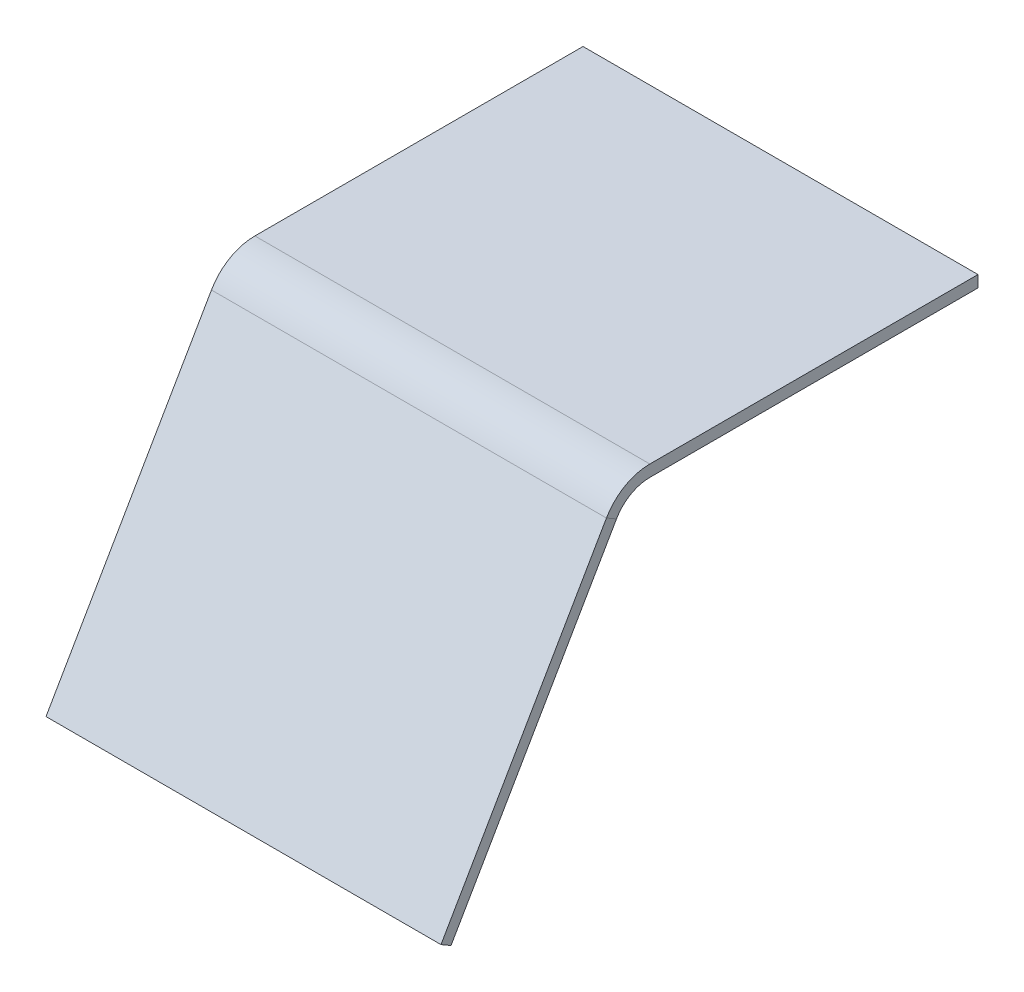
ISO-10303-21;
HEADER;
FILE_DESCRIPTION(('STEP AP214'),'2;1');
FILE_NAME('part.step','',(''),(''),'','','');
FILE_SCHEMA(('AUTOMOTIVE_DESIGN { 1 0 10303 214 1 1 1 1 }'));
ENDSEC;
DATA;
#1=APPLICATION_CONTEXT('core data for automotive mechanical design processes');
#2=APPLICATION_PROTOCOL_DEFINITION('international standard','automotive_design',2000,#1);
#3=PRODUCT_CONTEXT('',#1,'mechanical');
#4=PRODUCT('Part','Part','',(#3));
#5=PRODUCT_RELATED_PRODUCT_CATEGORY('part','',(#4));
#6=PRODUCT_DEFINITION_FORMATION('','',#4);
#7=PRODUCT_DEFINITION_CONTEXT('part definition',#1,'design');
#8=PRODUCT_DEFINITION('design','',#6,#7);
#9=PRODUCT_DEFINITION_SHAPE('','',#8);
#10=(LENGTH_UNIT() NAMED_UNIT(*) SI_UNIT(.MILLI.,.METRE.));
#11=(NAMED_UNIT(*) PLANE_ANGLE_UNIT() SI_UNIT($,.RADIAN.));
#12=(NAMED_UNIT(*) SI_UNIT($,.STERADIAN.) SOLID_ANGLE_UNIT());
#13=UNCERTAINTY_MEASURE_WITH_UNIT(LENGTH_MEASURE(1.E-05),#10,'distance_accuracy_value','');
#14=(GEOMETRIC_REPRESENTATION_CONTEXT(3) GLOBAL_UNCERTAINTY_ASSIGNED_CONTEXT((#13)) GLOBAL_UNIT_ASSIGNED_CONTEXT((#10,
#11,#12)) REPRESENTATION_CONTEXT('',''));
#15=CARTESIAN_POINT('',(0.,0.,0.));
#16=DIRECTION('',(0.,0.,1.));
#17=DIRECTION('',(1.,0.,0.));
#18=AXIS2_PLACEMENT_3D('',#15,#16,#17);
#19=CARTESIAN_POINT('',(34.,-1.,0.));
#20=DIRECTION('',(0.,1.,0.));
#21=DIRECTION('',(0.,0.,1.));
#22=AXIS2_PLACEMENT_3D('',#19,#20,#21);
#23=PLANE('',#22);
#24=DIRECTION('',(0.,0.,-1.));
#25=VECTOR('',#24,1.);
#26=CARTESIAN_POINT('',(0.,-1.,0.));
#27=LINE('',#26,#25);
#28=CARTESIAN_POINT('',(0.,-1.,0.));
#29=VERTEX_POINT('',#28);
#30=CARTESIAN_POINT('',(0.,-1.,-28.2470819010456));
#31=VERTEX_POINT('',#30);
#32=EDGE_CURVE('E120',#29,#31,#27,.T.);
#33=ORIENTED_EDGE('',*,*,#32,.T.);
#34=DIRECTION('',(-1.,0.,0.));
#35=VECTOR('',#34,1.);
#36=CARTESIAN_POINT('',(34.,-1.,-28.2470819010456));
#37=LINE('',#36,#35);
#38=CARTESIAN_POINT('',(34.,-1.,-28.2470819010456));
#39=VERTEX_POINT('',#38);
#40=EDGE_CURVE('E11',#39,#31,#37,.T.);
#41=ORIENTED_EDGE('',*,*,#40,.F.);
#42=DIRECTION('',(0.,0.,-1.));
#43=VECTOR('',#42,1.);
#44=CARTESIAN_POINT('',(34.,-1.,0.));
#45=LINE('',#44,#43);
#46=CARTESIAN_POINT('',(34.,-1.,0.));
#47=VERTEX_POINT('',#46);
#48=EDGE_CURVE('E57',#47,#39,#45,.T.);
#49=ORIENTED_EDGE('',*,*,#48,.F.);
#50=DIRECTION('',(-1.,0.,0.));
#51=VECTOR('',#50,1.);
#52=CARTESIAN_POINT('',(34.,-1.,0.));
#53=LINE('',#52,#51);
#54=EDGE_CURVE('E76',#47,#29,#53,.T.);
#55=ORIENTED_EDGE('',*,*,#54,.T.);
#56=EDGE_LOOP('',(#33,#41,#49,#55));
#57=FACE_BOUND('',#56,.T.);
#58=ADVANCED_FACE('F41',(#57),#23,.F.);
#59=CARTESIAN_POINT('',(34.,0.,-28.2470819010456));
#60=DIRECTION('',(0.,0.,-1.));
#61=DIRECTION('',(-1.,0.,0.));
#62=AXIS2_PLACEMENT_3D('',#59,#60,#61);
#63=PLANE('',#62);
#64=DIRECTION('',(0.,-1.,0.));
#65=VECTOR('',#64,1.);
#66=CARTESIAN_POINT('',(0.,0.,-28.2470819010456));
#67=LINE('',#66,#65);
#68=CARTESIAN_POINT('',(0.,0.,-28.2470819010456));
#69=VERTEX_POINT('',#68);
#70=EDGE_CURVE('E179',#69,#31,#67,.T.);
#71=ORIENTED_EDGE('',*,*,#70,.F.);
#72=DIRECTION('',(-1.,0.,0.));
#73=VECTOR('',#72,1.);
#74=CARTESIAN_POINT('',(34.,0.,-28.2470819010456));
#75=LINE('',#74,#73);
#76=CARTESIAN_POINT('',(34.,0.,-28.2470819010456));
#77=VERTEX_POINT('',#76);
#78=EDGE_CURVE('E49',#77,#69,#75,.T.);
#79=ORIENTED_EDGE('',*,*,#78,.F.);
#80=DIRECTION('',(0.,-1.,0.));
#81=VECTOR('',#80,1.);
#82=CARTESIAN_POINT('',(34.,0.,-28.2470819010456));
#83=LINE('',#82,#81);
#84=EDGE_CURVE('E173',#77,#39,#83,.T.);
#85=ORIENTED_EDGE('',*,*,#84,.T.);
#86=ORIENTED_EDGE('',*,*,#40,.T.);
#87=EDGE_LOOP('',(#71,#79,#85,#86));
#88=FACE_BOUND('',#87,.T.);
#89=ADVANCED_FACE('F187',(#88),#63,.T.);
#90=CARTESIAN_POINT('',(34.,0.,0.));
#91=DIRECTION('',(0.,1.,0.));
#92=DIRECTION('',(0.,0.,1.));
#93=AXIS2_PLACEMENT_3D('',#90,#91,#92);
#94=PLANE('',#93);
#95=DIRECTION('',(0.,0.,-1.));
#96=VECTOR('',#95,1.);
#97=CARTESIAN_POINT('',(0.,0.,0.));
#98=LINE('',#97,#96);
#99=CARTESIAN_POINT('',(0.,0.,0.));
#100=VERTEX_POINT('',#99);
#101=EDGE_CURVE('E174',#100,#69,#98,.T.);
#102=ORIENTED_EDGE('',*,*,#101,.F.);
#103=DIRECTION('',(-1.,0.,0.));
#104=VECTOR('',#103,1.);
#105=CARTESIAN_POINT('',(34.,0.,0.));
#106=LINE('',#105,#104);
#107=CARTESIAN_POINT('',(34.,0.,0.));
#108=VERTEX_POINT('',#107);
#109=EDGE_CURVE('E136',#108,#100,#106,.T.);
#110=ORIENTED_EDGE('',*,*,#109,.F.);
#111=DIRECTION('',(0.,0.,-1.));
#112=VECTOR('',#111,1.);
#113=CARTESIAN_POINT('',(34.,0.,0.));
#114=LINE('',#113,#112);
#115=EDGE_CURVE('E141',#108,#77,#114,.T.);
#116=ORIENTED_EDGE('',*,*,#115,.T.);
#117=ORIENTED_EDGE('',*,*,#78,.T.);
#118=EDGE_LOOP('',(#102,#110,#116,#117));
#119=FACE_BOUND('',#118,.T.);
#120=ADVANCED_FACE('F185',(#119),#94,.T.);
#121=CARTESIAN_POINT('',(34.,0.,0.));
#122=DIRECTION('',(-1.,0.,0.));
#123=DIRECTION('',(0.,0.,1.));
#124=AXIS2_PLACEMENT_3D('',#121,#122,#123);
#125=PLANE('',#124);
#126=ORIENTED_EDGE('',*,*,#48,.T.);
#127=ORIENTED_EDGE('',*,*,#84,.F.);
#128=ORIENTED_EDGE('',*,*,#115,.F.);
#129=CARTESIAN_POINT('',(34.,-4.31610220221758,0.));
#130=DIRECTION('',(1.,0.,0.));
#131=DIRECTION('',(0.,0.,-1.));
#132=AXIS2_PLACEMENT_3D('',#129,#130,#131);
#133=CIRCLE('',#132,4.31610220221758);
#134=CARTESIAN_POINT('',(34.,-2.15902582062631,3.7384167376001));
#135=VERTEX_POINT('',#134);
#136=EDGE_CURVE('E130',#135,#108,#133,.F.);
#137=ORIENTED_EDGE('',*,*,#136,.F.);
#138=DIRECTION('',(0.,0.499774166719912,0.866155749435064));
#139=VECTOR('',#138,1.);
#140=CARTESIAN_POINT('',(34.,-2.65879998734622,2.87226098816503));
#141=LINE('',#140,#139);
#142=CARTESIAN_POINT('',(34.,-2.65879998734622,2.87226098816503));
#143=VERTEX_POINT('',#142);
#144=EDGE_CURVE('E109',#143,#135,#141,.T.);
#145=ORIENTED_EDGE('',*,*,#144,.F.);
#146=CARTESIAN_POINT('',(34.,-4.31610220221758,0.));
#147=DIRECTION('',(-1.,0.,0.));
#148=DIRECTION('',(0.,0.,1.));
#149=AXIS2_PLACEMENT_3D('',#146,#147,#148);
#150=CIRCLE('',#149,3.31610220221758);
#151=EDGE_CURVE('E142',#143,#47,#150,.T.);
#152=ORIENTED_EDGE('',*,*,#151,.T.);
#153=EDGE_LOOP('',(#126,#127,#128,#137,#145,#152));
#154=FACE_BOUND('',#153,.T.);
#155=ADVANCED_FACE('F140',(#154),#125,.F.);
#156=CARTESIAN_POINT('',(0.,0.,0.));
#157=DIRECTION('',(-1.,0.,0.));
#158=DIRECTION('',(0.,0.,1.));
#159=AXIS2_PLACEMENT_3D('',#156,#157,#158);
#160=PLANE('',#159);
#161=ORIENTED_EDGE('',*,*,#32,.F.);
#162=CARTESIAN_POINT('',(0.,-4.31610220221758,0.));
#163=DIRECTION('',(-1.,0.,0.));
#164=DIRECTION('',(0.,0.,1.));
#165=AXIS2_PLACEMENT_3D('',#162,#163,#164);
#166=CIRCLE('',#165,3.31610220221758);
#167=CARTESIAN_POINT('',(0.,-2.65879998734622,2.87226098816503));
#168=VERTEX_POINT('',#167);
#169=EDGE_CURVE('E152',#168,#29,#166,.T.);
#170=ORIENTED_EDGE('',*,*,#169,.F.);
#171=DIRECTION('',(0.,-0.499774166719912,-0.866155749435064));
#172=VECTOR('',#171,1.);
#173=CARTESIAN_POINT('',(0.,-2.15902582062631,3.7384167376001));
#174=LINE('',#173,#172);
#175=CARTESIAN_POINT('',(0.,-2.15902582062631,3.7384167376001));
#176=VERTEX_POINT('',#175);
#177=EDGE_CURVE('E121',#176,#168,#174,.T.);
#178=ORIENTED_EDGE('',*,*,#177,.F.);
#179=CARTESIAN_POINT('',(0.,-4.31610220221758,0.));
#180=DIRECTION('',(1.,0.,0.));
#181=DIRECTION('',(0.,0.,-1.));
#182=AXIS2_PLACEMENT_3D('',#179,#180,#181);
#183=CIRCLE('',#182,4.31610220221758);
#184=EDGE_CURVE('E132',#176,#100,#183,.F.);
#185=ORIENTED_EDGE('',*,*,#184,.T.);
#186=ORIENTED_EDGE('',*,*,#101,.T.);
#187=ORIENTED_EDGE('',*,*,#70,.T.);
#188=EDGE_LOOP('',(#161,#170,#178,#185,#186,#187));
#189=FACE_BOUND('',#188,.T.);
#190=ADVANCED_FACE('F184',(#189),#160,.T.);
#191=CARTESIAN_POINT('',(34.,-4.31610220221758,0.));
#192=DIRECTION('',(-1.,0.,0.));
#193=DIRECTION('',(0.,0.,1.));
#194=AXIS2_PLACEMENT_3D('',#191,#192,#193);
#195=CYLINDRICAL_SURFACE('',#194,3.31610220221758);
#196=ORIENTED_EDGE('',*,*,#169,.T.);
#197=ORIENTED_EDGE('',*,*,#54,.F.);
#198=ORIENTED_EDGE('',*,*,#151,.F.);
#199=DIRECTION('',(-1.,0.,0.));
#200=VECTOR('',#199,1.);
#201=CARTESIAN_POINT('',(34.,-2.65879998734622,2.87226098816503));
#202=LINE('',#201,#200);
#203=EDGE_CURVE('E151',#143,#168,#202,.T.);
#204=ORIENTED_EDGE('',*,*,#203,.T.);
#205=EDGE_LOOP('',(#196,#197,#198,#204));
#206=FACE_BOUND('',#205,.T.);
#207=ADVANCED_FACE('F201',(#206),#195,.F.);
#208=CARTESIAN_POINT('',(34.,-4.31610220221758,0.));
#209=DIRECTION('',(-1.,0.,0.));
#210=DIRECTION('',(0.,0.,1.));
#211=AXIS2_PLACEMENT_3D('',#208,#209,#210);
#212=CYLINDRICAL_SURFACE('',#211,4.31610220221758);
#213=ORIENTED_EDGE('',*,*,#184,.F.);
#214=DIRECTION('',(-1.,0.,0.));
#215=VECTOR('',#214,1.);
#216=CARTESIAN_POINT('',(34.,-2.15902582062631,3.7384167376001));
#217=LINE('',#216,#215);
#218=EDGE_CURVE('E127',#135,#176,#217,.T.);
#219=ORIENTED_EDGE('',*,*,#218,.F.);
#220=ORIENTED_EDGE('',*,*,#136,.T.);
#221=ORIENTED_EDGE('',*,*,#109,.T.);
#222=EDGE_LOOP('',(#213,#219,#220,#221));
#223=FACE_BOUND('',#222,.T.);
#224=ADVANCED_FACE('F128',(#223),#212,.T.);
#225=CARTESIAN_POINT('',(34.,-2.15902582062631,3.7384167376001));
#226=DIRECTION('',(0.,0.499774166719912,0.866155749435064));
#227=DIRECTION('',(0.,-0.866155749435064,0.499774166719912));
#228=AXIS2_PLACEMENT_3D('',#225,#226,#227);
#229=PLANE('',#228);
#230=DIRECTION('',(0.,0.866155749435064,-0.499774166719912));
#231=VECTOR('',#230,1.);
#232=CARTESIAN_POINT('',(0.,-2.15902582062631,3.7384167376001));
#233=LINE('',#232,#231);
#234=CARTESIAN_POINT('',(0.,-26.8403419513742,17.97960166403));
#235=VERTEX_POINT('',#234);
#236=EDGE_CURVE('E156',#235,#176,#233,.T.);
#237=ORIENTED_EDGE('',*,*,#236,.F.);
#238=DIRECTION('',(-1.,0.,0.));
#239=VECTOR('',#238,1.);
#240=CARTESIAN_POINT('',(34.,-26.8403419513742,17.97960166403));
#241=LINE('',#240,#239);
#242=CARTESIAN_POINT('',(34.,-26.8403419513742,17.97960166403));
#243=VERTEX_POINT('',#242);
#244=EDGE_CURVE('E137',#243,#235,#241,.T.);
#245=ORIENTED_EDGE('',*,*,#244,.F.);
#246=DIRECTION('',(0.,0.866155749435064,-0.499774166719912));
#247=VECTOR('',#246,1.);
#248=CARTESIAN_POINT('',(34.,-2.15902582062631,3.7384167376001));
#249=LINE('',#248,#247);
#250=EDGE_CURVE('E114',#243,#135,#249,.T.);
#251=ORIENTED_EDGE('',*,*,#250,.T.);
#252=ORIENTED_EDGE('',*,*,#218,.T.);
#253=EDGE_LOOP('',(#237,#245,#251,#252));
#254=FACE_BOUND('',#253,.T.);
#255=ADVANCED_FACE('F144',(#254),#229,.T.);
#256=CARTESIAN_POINT('',(34.,-27.3401161180941,17.1134459145949));
#257=DIRECTION('',(0.,-0.866155749435066,0.49977416671991));
#258=DIRECTION('',(0.,-0.49977416671991,-0.866155749435066));
#259=AXIS2_PLACEMENT_3D('',#256,#257,#258);
#260=PLANE('',#259);
#261=DIRECTION('',(0.,0.49977416671991,0.866155749435065));
#262=VECTOR('',#261,1.);
#263=CARTESIAN_POINT('',(0.,-27.3401161180941,17.1134459145949));
#264=LINE('',#263,#262);
#265=CARTESIAN_POINT('',(0.,-27.3401161180941,17.1134459145949));
#266=VERTEX_POINT('',#265);
#267=EDGE_CURVE('E158',#266,#235,#264,.T.);
#268=ORIENTED_EDGE('',*,*,#267,.F.);
#269=DIRECTION('',(-1.,0.,0.));
#270=VECTOR('',#269,1.);
#271=CARTESIAN_POINT('',(34.,-27.3401161180941,17.1134459145949));
#272=LINE('',#271,#270);
#273=CARTESIAN_POINT('',(34.,-27.3401161180941,17.1134459145949));
#274=VERTEX_POINT('',#273);
#275=EDGE_CURVE('E166',#274,#266,#272,.T.);
#276=ORIENTED_EDGE('',*,*,#275,.F.);
#277=DIRECTION('',(0.,0.49977416671991,0.866155749435065));
#278=VECTOR('',#277,1.);
#279=CARTESIAN_POINT('',(34.,-27.3401161180941,17.1134459145949));
#280=LINE('',#279,#278);
#281=EDGE_CURVE('E145',#274,#243,#280,.T.);
#282=ORIENTED_EDGE('',*,*,#281,.T.);
#283=ORIENTED_EDGE('',*,*,#244,.T.);
#284=EDGE_LOOP('',(#268,#276,#282,#283));
#285=FACE_BOUND('',#284,.T.);
#286=ADVANCED_FACE('F210',(#285),#260,.T.);
#287=CARTESIAN_POINT('',(34.,-2.65879998734622,2.87226098816503));
#288=DIRECTION('',(0.,0.499774166719912,0.866155749435064));
#289=DIRECTION('',(0.,-0.866155749435064,0.499774166719912));
#290=AXIS2_PLACEMENT_3D('',#287,#288,#289);
#291=PLANE('',#290);
#292=DIRECTION('',(0.,0.866155749435064,-0.499774166719912));
#293=VECTOR('',#292,1.);
#294=CARTESIAN_POINT('',(0.,-2.65879998734622,2.87226098816503));
#295=LINE('',#294,#293);
#296=EDGE_CURVE('E161',#266,#168,#295,.T.);
#297=ORIENTED_EDGE('',*,*,#296,.T.);
#298=ORIENTED_EDGE('',*,*,#203,.F.);
#299=DIRECTION('',(0.,0.866155749435064,-0.499774166719912));
#300=VECTOR('',#299,1.);
#301=CARTESIAN_POINT('',(34.,-2.65879998734622,2.87226098816503));
#302=LINE('',#301,#300);
#303=EDGE_CURVE('E117',#274,#143,#302,.T.);
#304=ORIENTED_EDGE('',*,*,#303,.F.);
#305=ORIENTED_EDGE('',*,*,#275,.T.);
#306=EDGE_LOOP('',(#297,#298,#304,#305));
#307=FACE_BOUND('',#306,.T.);
#308=ADVANCED_FACE('F204',(#307),#291,.F.);
#309=CARTESIAN_POINT('',(34.,-4.31610220221758,0.));
#310=DIRECTION('',(-1.,0.,0.));
#311=DIRECTION('',(0.,0.,1.));
#312=AXIS2_PLACEMENT_3D('',#309,#310,#311);
#313=PLANE('',#312);
#314=ORIENTED_EDGE('',*,*,#303,.T.);
#315=ORIENTED_EDGE('',*,*,#144,.T.);
#316=ORIENTED_EDGE('',*,*,#250,.F.);
#317=ORIENTED_EDGE('',*,*,#281,.F.);
#318=EDGE_LOOP('',(#314,#315,#316,#317));
#319=FACE_BOUND('',#318,.T.);
#320=ADVANCED_FACE('F111',(#319),#313,.F.);
#321=CARTESIAN_POINT('',(0.,-4.31610220221758,0.));
#322=DIRECTION('',(-1.,0.,0.));
#323=DIRECTION('',(0.,0.,1.));
#324=AXIS2_PLACEMENT_3D('',#321,#322,#323);
#325=PLANE('',#324);
#326=ORIENTED_EDGE('',*,*,#236,.T.);
#327=ORIENTED_EDGE('',*,*,#177,.T.);
#328=ORIENTED_EDGE('',*,*,#296,.F.);
#329=ORIENTED_EDGE('',*,*,#267,.T.);
#330=EDGE_LOOP('',(#326,#327,#328,#329));
#331=FACE_BOUND('',#330,.T.);
#332=ADVANCED_FACE('F208',(#331),#325,.T.);
#333=CLOSED_SHELL('',(#58,#89,#120,#155,#190,#207,#224,#255,#286,#308,#320,#332));
#334=MANIFOLD_SOLID_BREP('B2',#333);
#335=ADVANCED_BREP_SHAPE_REPRESENTATION('',(#18,#334),#14);
#336=SHAPE_DEFINITION_REPRESENTATION(#9,#335);
ENDSEC;
END-ISO-10303-21;
